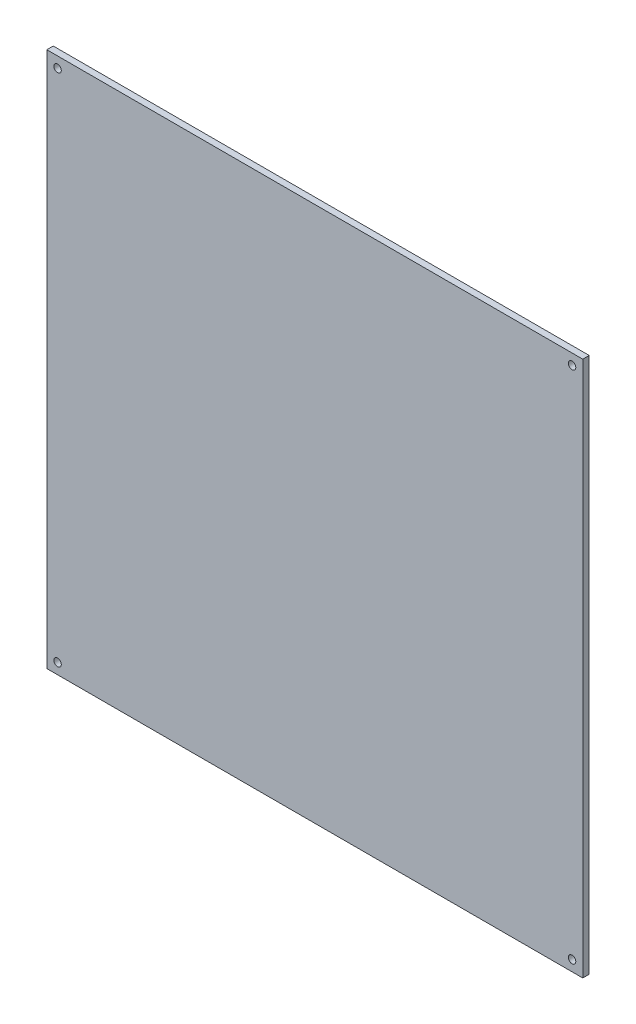
ISO-10303-21;
HEADER;
FILE_DESCRIPTION(('STEP AP214'),'2;1');
FILE_NAME('part.step','',(''),(''),'','','');
FILE_SCHEMA(('AUTOMOTIVE_DESIGN { 1 0 10303 214 1 1 1 1 }'));
ENDSEC;
DATA;
#1=APPLICATION_CONTEXT('core data for automotive mechanical design processes');
#2=APPLICATION_PROTOCOL_DEFINITION('international standard','automotive_design',2000,#1);
#3=PRODUCT_CONTEXT('',#1,'mechanical');
#4=PRODUCT('Part','Part','',(#3));
#5=PRODUCT_RELATED_PRODUCT_CATEGORY('part','',(#4));
#6=PRODUCT_DEFINITION_FORMATION('','',#4);
#7=PRODUCT_DEFINITION_CONTEXT('part definition',#1,'design');
#8=PRODUCT_DEFINITION('design','',#6,#7);
#9=PRODUCT_DEFINITION_SHAPE('','',#8);
#10=(LENGTH_UNIT() NAMED_UNIT(*) SI_UNIT(.MILLI.,.METRE.));
#11=(NAMED_UNIT(*) PLANE_ANGLE_UNIT() SI_UNIT($,.RADIAN.));
#12=(NAMED_UNIT(*) SI_UNIT($,.STERADIAN.) SOLID_ANGLE_UNIT());
#13=UNCERTAINTY_MEASURE_WITH_UNIT(LENGTH_MEASURE(1.E-05),#10,'distance_accuracy_value','');
#14=(GEOMETRIC_REPRESENTATION_CONTEXT(3) GLOBAL_UNCERTAINTY_ASSIGNED_CONTEXT((#13)) GLOBAL_UNIT_ASSIGNED_CONTEXT((#10,
#11,#12)) REPRESENTATION_CONTEXT('',''));
#15=CARTESIAN_POINT('',(0.,0.,0.));
#16=DIRECTION('',(0.,0.,1.));
#17=DIRECTION('',(1.,0.,0.));
#18=AXIS2_PLACEMENT_3D('',#15,#16,#17);
#19=CARTESIAN_POINT('',(125.,125.,3.));
#20=DIRECTION('',(-1.,0.,0.));
#21=DIRECTION('',(0.,-1.,0.));
#22=AXIS2_PLACEMENT_3D('',#19,#20,#21);
#23=PLANE('',#22);
#24=DIRECTION('',(0.,1.,0.));
#25=VECTOR('',#24,1.);
#26=CARTESIAN_POINT('',(125.,125.,0.));
#27=LINE('',#26,#25);
#28=CARTESIAN_POINT('',(125.,-125.,0.));
#29=VERTEX_POINT('',#28);
#30=CARTESIAN_POINT('',(125.,125.,0.));
#31=VERTEX_POINT('',#30);
#32=EDGE_CURVE('E96',#29,#31,#27,.T.);
#33=ORIENTED_EDGE('',*,*,#32,.T.);
#34=DIRECTION('',(0.,0.,-1.));
#35=VECTOR('',#34,1.);
#36=CARTESIAN_POINT('',(125.,125.,3.));
#37=LINE('',#36,#35);
#38=CARTESIAN_POINT('',(125.,125.,3.));
#39=VERTEX_POINT('',#38);
#40=EDGE_CURVE('E11',#39,#31,#37,.T.);
#41=ORIENTED_EDGE('',*,*,#40,.F.);
#42=DIRECTION('',(0.,1.,0.));
#43=VECTOR('',#42,1.);
#44=CARTESIAN_POINT('',(125.,125.,3.));
#45=LINE('',#44,#43);
#46=CARTESIAN_POINT('',(125.,-125.,3.));
#47=VERTEX_POINT('',#46);
#48=EDGE_CURVE('E84',#47,#39,#45,.T.);
#49=ORIENTED_EDGE('',*,*,#48,.F.);
#50=DIRECTION('',(0.,0.,-1.));
#51=VECTOR('',#50,1.);
#52=CARTESIAN_POINT('',(125.,-125.,3.));
#53=LINE('',#52,#51);
#54=EDGE_CURVE('E92',#47,#29,#53,.T.);
#55=ORIENTED_EDGE('',*,*,#54,.T.);
#56=EDGE_LOOP('',(#33,#41,#49,#55));
#57=FACE_BOUND('',#56,.T.);
#58=ADVANCED_FACE('F33',(#57),#23,.F.);
#59=CARTESIAN_POINT('',(-125.,125.,3.));
#60=DIRECTION('',(0.,-1.,0.));
#61=DIRECTION('',(0.,0.,-1.));
#62=AXIS2_PLACEMENT_3D('',#59,#60,#61);
#63=PLANE('',#62);
#64=DIRECTION('',(-1.,0.,0.));
#65=VECTOR('',#64,1.);
#66=CARTESIAN_POINT('',(-125.,125.,0.));
#67=LINE('',#66,#65);
#68=CARTESIAN_POINT('',(-125.,125.,0.));
#69=VERTEX_POINT('',#68);
#70=EDGE_CURVE('E88',#31,#69,#67,.T.);
#71=ORIENTED_EDGE('',*,*,#70,.T.);
#72=DIRECTION('',(0.,0.,-1.));
#73=VECTOR('',#72,1.);
#74=CARTESIAN_POINT('',(-125.,125.,3.));
#75=LINE('',#74,#73);
#76=CARTESIAN_POINT('',(-125.,125.,3.));
#77=VERTEX_POINT('',#76);
#78=EDGE_CURVE('E41',#77,#69,#75,.T.);
#79=ORIENTED_EDGE('',*,*,#78,.F.);
#80=DIRECTION('',(-1.,0.,0.));
#81=VECTOR('',#80,1.);
#82=CARTESIAN_POINT('',(-125.,125.,3.));
#83=LINE('',#82,#81);
#84=EDGE_CURVE('E79',#39,#77,#83,.T.);
#85=ORIENTED_EDGE('',*,*,#84,.F.);
#86=ORIENTED_EDGE('',*,*,#40,.T.);
#87=EDGE_LOOP('',(#71,#79,#85,#86));
#88=FACE_BOUND('',#87,.T.);
#89=ADVANCED_FACE('F87',(#88),#63,.F.);
#90=CARTESIAN_POINT('',(-125.,125.,3.));
#91=DIRECTION('',(1.,0.,0.));
#92=DIRECTION('',(0.,1.,0.));
#93=AXIS2_PLACEMENT_3D('',#90,#91,#92);
#94=PLANE('',#93);
#95=DIRECTION('',(0.,-1.,0.));
#96=VECTOR('',#95,1.);
#97=CARTESIAN_POINT('',(-125.,125.,0.));
#98=LINE('',#97,#96);
#99=CARTESIAN_POINT('',(-125.,-125.,0.));
#100=VERTEX_POINT('',#99);
#101=EDGE_CURVE('E66',#69,#100,#98,.T.);
#102=ORIENTED_EDGE('',*,*,#101,.T.);
#103=DIRECTION('',(0.,0.,-1.));
#104=VECTOR('',#103,1.);
#105=CARTESIAN_POINT('',(-125.,-125.,3.));
#106=LINE('',#105,#104);
#107=CARTESIAN_POINT('',(-125.,-125.,3.));
#108=VERTEX_POINT('',#107);
#109=EDGE_CURVE('E89',#108,#100,#106,.T.);
#110=ORIENTED_EDGE('',*,*,#109,.F.);
#111=DIRECTION('',(0.,-1.,0.));
#112=VECTOR('',#111,1.);
#113=CARTESIAN_POINT('',(-125.,125.,3.));
#114=LINE('',#113,#112);
#115=EDGE_CURVE('E82',#77,#108,#114,.T.);
#116=ORIENTED_EDGE('',*,*,#115,.F.);
#117=ORIENTED_EDGE('',*,*,#78,.T.);
#118=EDGE_LOOP('',(#102,#110,#116,#117));
#119=FACE_BOUND('',#118,.T.);
#120=ADVANCED_FACE('F90',(#119),#94,.F.);
#121=CARTESIAN_POINT('',(-125.,-125.,3.));
#122=DIRECTION('',(0.,1.,0.));
#123=DIRECTION('',(0.,0.,1.));
#124=AXIS2_PLACEMENT_3D('',#121,#122,#123);
#125=PLANE('',#124);
#126=DIRECTION('',(1.,0.,0.));
#127=VECTOR('',#126,1.);
#128=CARTESIAN_POINT('',(-125.,-125.,0.));
#129=LINE('',#128,#127);
#130=EDGE_CURVE('E72',#100,#29,#129,.T.);
#131=ORIENTED_EDGE('',*,*,#130,.T.);
#132=ORIENTED_EDGE('',*,*,#54,.F.);
#133=DIRECTION('',(1.,0.,0.));
#134=VECTOR('',#133,1.);
#135=CARTESIAN_POINT('',(-125.,-125.,3.));
#136=LINE('',#135,#134);
#137=EDGE_CURVE('E49',#108,#47,#136,.T.);
#138=ORIENTED_EDGE('',*,*,#137,.F.);
#139=ORIENTED_EDGE('',*,*,#109,.T.);
#140=EDGE_LOOP('',(#131,#132,#138,#139));
#141=FACE_BOUND('',#140,.T.);
#142=ADVANCED_FACE('F104',(#141),#125,.F.);
#143=CARTESIAN_POINT('',(0.,0.,3.));
#144=DIRECTION('',(0.,0.,1.));
#145=DIRECTION('',(1.,0.,0.));
#146=AXIS2_PLACEMENT_3D('',#143,#144,#145);
#147=PLANE('',#146);
#148=CARTESIAN_POINT('',(120.,-120.,3.));
#149=DIRECTION('',(0.,0.,1.));
#150=DIRECTION('',(1.,0.,0.));
#151=AXIS2_PLACEMENT_3D('',#148,#149,#150);
#152=CIRCLE('',#151,1.75);
#153=CARTESIAN_POINT('',(121.75,-120.,3.));
#154=VERTEX_POINT('',#153);
#155=EDGE_CURVE('E128',#154,#154,#152,.T.);
#156=ORIENTED_EDGE('',*,*,#155,.F.);
#157=EDGE_LOOP('',(#156));
#158=FACE_BOUND('',#157,.T.);
#159=CARTESIAN_POINT('',(-120.,-120.,3.));
#160=DIRECTION('',(0.,0.,1.));
#161=DIRECTION('',(1.,0.,0.));
#162=AXIS2_PLACEMENT_3D('',#159,#160,#161);
#163=CIRCLE('',#162,1.75);
#164=CARTESIAN_POINT('',(-118.25,-120.,3.));
#165=VERTEX_POINT('',#164);
#166=EDGE_CURVE('E122',#165,#165,#163,.T.);
#167=ORIENTED_EDGE('',*,*,#166,.F.);
#168=EDGE_LOOP('',(#167));
#169=FACE_BOUND('',#168,.T.);
#170=CARTESIAN_POINT('',(120.,120.,3.));
#171=DIRECTION('',(0.,0.,1.));
#172=DIRECTION('',(1.,0.,0.));
#173=AXIS2_PLACEMENT_3D('',#170,#171,#172);
#174=CIRCLE('',#173,1.75);
#175=CARTESIAN_POINT('',(121.75,120.,3.));
#176=VERTEX_POINT('',#175);
#177=EDGE_CURVE('E116',#176,#176,#174,.T.);
#178=ORIENTED_EDGE('',*,*,#177,.F.);
#179=EDGE_LOOP('',(#178));
#180=FACE_BOUND('',#179,.T.);
#181=CARTESIAN_POINT('',(-120.,120.,3.));
#182=DIRECTION('',(0.,0.,1.));
#183=DIRECTION('',(1.,0.,0.));
#184=AXIS2_PLACEMENT_3D('',#181,#182,#183);
#185=CIRCLE('',#184,1.75);
#186=CARTESIAN_POINT('',(-118.25,120.,3.));
#187=VERTEX_POINT('',#186);
#188=EDGE_CURVE('E110',#187,#187,#185,.T.);
#189=ORIENTED_EDGE('',*,*,#188,.F.);
#190=EDGE_LOOP('',(#189));
#191=FACE_BOUND('',#190,.T.);
#192=ORIENTED_EDGE('',*,*,#48,.T.);
#193=ORIENTED_EDGE('',*,*,#84,.T.);
#194=ORIENTED_EDGE('',*,*,#115,.T.);
#195=ORIENTED_EDGE('',*,*,#137,.T.);
#196=EDGE_LOOP('',(#192,#193,#194,#195));
#197=FACE_BOUND('',#196,.T.);
#198=ADVANCED_FACE('F80',(#158,#169,#180,#191,#197),#147,.T.);
#199=CARTESIAN_POINT('',(0.,0.,0.));
#200=DIRECTION('',(0.,0.,1.));
#201=DIRECTION('',(1.,0.,0.));
#202=AXIS2_PLACEMENT_3D('',#199,#200,#201);
#203=PLANE('',#202);
#204=CARTESIAN_POINT('',(120.,-120.,0.));
#205=DIRECTION('',(0.,0.,1.));
#206=DIRECTION('',(1.,0.,0.));
#207=AXIS2_PLACEMENT_3D('',#204,#205,#206);
#208=CIRCLE('',#207,1.75);
#209=CARTESIAN_POINT('',(121.75,-120.,0.));
#210=VERTEX_POINT('',#209);
#211=EDGE_CURVE('E125',#210,#210,#208,.T.);
#212=ORIENTED_EDGE('',*,*,#211,.T.);
#213=EDGE_LOOP('',(#212));
#214=FACE_BOUND('',#213,.T.);
#215=CARTESIAN_POINT('',(-120.,-120.,0.));
#216=DIRECTION('',(0.,0.,1.));
#217=DIRECTION('',(1.,0.,0.));
#218=AXIS2_PLACEMENT_3D('',#215,#216,#217);
#219=CIRCLE('',#218,1.75);
#220=CARTESIAN_POINT('',(-118.25,-120.,0.));
#221=VERTEX_POINT('',#220);
#222=EDGE_CURVE('E119',#221,#221,#219,.T.);
#223=ORIENTED_EDGE('',*,*,#222,.T.);
#224=EDGE_LOOP('',(#223));
#225=FACE_BOUND('',#224,.T.);
#226=CARTESIAN_POINT('',(120.,120.,0.));
#227=DIRECTION('',(0.,0.,1.));
#228=DIRECTION('',(1.,0.,0.));
#229=AXIS2_PLACEMENT_3D('',#226,#227,#228);
#230=CIRCLE('',#229,1.75);
#231=CARTESIAN_POINT('',(121.75,120.,0.));
#232=VERTEX_POINT('',#231);
#233=EDGE_CURVE('E113',#232,#232,#230,.T.);
#234=ORIENTED_EDGE('',*,*,#233,.T.);
#235=EDGE_LOOP('',(#234));
#236=FACE_BOUND('',#235,.T.);
#237=CARTESIAN_POINT('',(-120.,120.,0.));
#238=DIRECTION('',(0.,0.,1.));
#239=DIRECTION('',(1.,0.,0.));
#240=AXIS2_PLACEMENT_3D('',#237,#238,#239);
#241=CIRCLE('',#240,1.75);
#242=CARTESIAN_POINT('',(-118.25,120.,0.));
#243=VERTEX_POINT('',#242);
#244=EDGE_CURVE('E99',#243,#243,#241,.T.);
#245=ORIENTED_EDGE('',*,*,#244,.T.);
#246=EDGE_LOOP('',(#245));
#247=FACE_BOUND('',#246,.T.);
#248=ORIENTED_EDGE('',*,*,#32,.F.);
#249=ORIENTED_EDGE('',*,*,#130,.F.);
#250=ORIENTED_EDGE('',*,*,#101,.F.);
#251=ORIENTED_EDGE('',*,*,#70,.F.);
#252=EDGE_LOOP('',(#248,#249,#250,#251));
#253=FACE_BOUND('',#252,.T.);
#254=ADVANCED_FACE('F107',(#214,#225,#236,#247,#253),#203,.F.);
#255=CARTESIAN_POINT('',(-120.,120.,0.));
#256=DIRECTION('',(0.,0.,1.));
#257=DIRECTION('',(1.,0.,0.));
#258=AXIS2_PLACEMENT_3D('',#255,#256,#257);
#259=CYLINDRICAL_SURFACE('',#258,1.75);
#260=ORIENTED_EDGE('',*,*,#244,.F.);
#261=EDGE_LOOP('',(#260));
#262=FACE_BOUND('',#261,.T.);
#263=ORIENTED_EDGE('',*,*,#188,.T.);
#264=EDGE_LOOP('',(#263));
#265=FACE_BOUND('',#264,.T.);
#266=ADVANCED_FACE('F152',(#262,#265),#259,.F.);
#267=CARTESIAN_POINT('',(120.,120.,0.));
#268=DIRECTION('',(0.,0.,1.));
#269=DIRECTION('',(1.,0.,0.));
#270=AXIS2_PLACEMENT_3D('',#267,#268,#269);
#271=CYLINDRICAL_SURFACE('',#270,1.75);
#272=ORIENTED_EDGE('',*,*,#233,.F.);
#273=EDGE_LOOP('',(#272));
#274=FACE_BOUND('',#273,.T.);
#275=ORIENTED_EDGE('',*,*,#177,.T.);
#276=EDGE_LOOP('',(#275));
#277=FACE_BOUND('',#276,.T.);
#278=ADVANCED_FACE('F154',(#274,#277),#271,.F.);
#279=CARTESIAN_POINT('',(-120.,-120.,0.));
#280=DIRECTION('',(0.,0.,1.));
#281=DIRECTION('',(1.,0.,0.));
#282=AXIS2_PLACEMENT_3D('',#279,#280,#281);
#283=CYLINDRICAL_SURFACE('',#282,1.75);
#284=ORIENTED_EDGE('',*,*,#222,.F.);
#285=EDGE_LOOP('',(#284));
#286=FACE_BOUND('',#285,.T.);
#287=ORIENTED_EDGE('',*,*,#166,.T.);
#288=EDGE_LOOP('',(#287));
#289=FACE_BOUND('',#288,.T.);
#290=ADVANCED_FACE('F139',(#286,#289),#283,.F.);
#291=CARTESIAN_POINT('',(120.,-120.,0.));
#292=DIRECTION('',(0.,0.,1.));
#293=DIRECTION('',(1.,0.,0.));
#294=AXIS2_PLACEMENT_3D('',#291,#292,#293);
#295=CYLINDRICAL_SURFACE('',#294,1.75);
#296=ORIENTED_EDGE('',*,*,#211,.F.);
#297=EDGE_LOOP('',(#296));
#298=FACE_BOUND('',#297,.T.);
#299=ORIENTED_EDGE('',*,*,#155,.T.);
#300=EDGE_LOOP('',(#299));
#301=FACE_BOUND('',#300,.T.);
#302=ADVANCED_FACE('F136',(#298,#301),#295,.F.);
#303=CLOSED_SHELL('',(#58,#89,#120,#142,#198,#254,#266,#278,#290,#302));
#304=MANIFOLD_SOLID_BREP('B2',#303);
#305=ADVANCED_BREP_SHAPE_REPRESENTATION('',(#18,#304),#14);
#306=SHAPE_DEFINITION_REPRESENTATION(#9,#305);
ENDSEC;
END-ISO-10303-21;
